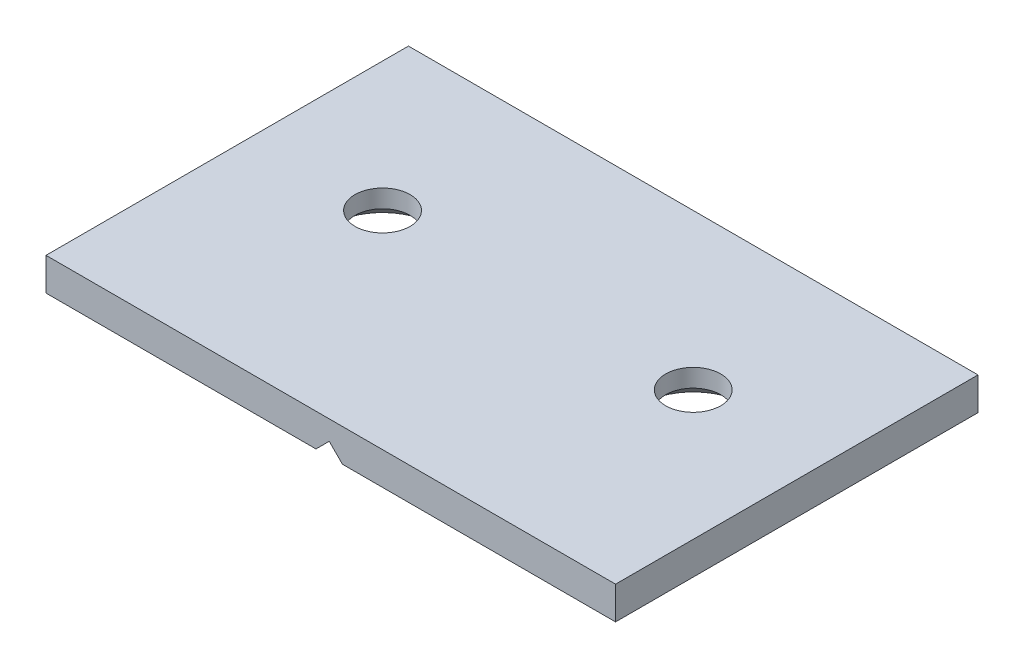
ISO-10303-21;
HEADER;
FILE_DESCRIPTION(('STEP AP214'),'2;1');
FILE_NAME('part.step','',(''),(''),'','','');
FILE_SCHEMA(('AUTOMOTIVE_DESIGN { 1 0 10303 214 1 1 1 1 }'));
ENDSEC;
DATA;
#1=APPLICATION_CONTEXT('core data for automotive mechanical design processes');
#2=APPLICATION_PROTOCOL_DEFINITION('international standard','automotive_design',2000,#1);
#3=PRODUCT_CONTEXT('',#1,'mechanical');
#4=PRODUCT('Part','Part','',(#3));
#5=PRODUCT_RELATED_PRODUCT_CATEGORY('part','',(#4));
#6=PRODUCT_DEFINITION_FORMATION('','',#4);
#7=PRODUCT_DEFINITION_CONTEXT('part definition',#1,'design');
#8=PRODUCT_DEFINITION('design','',#6,#7);
#9=PRODUCT_DEFINITION_SHAPE('','',#8);
#10=(LENGTH_UNIT() NAMED_UNIT(*) SI_UNIT(.MILLI.,.METRE.));
#11=(NAMED_UNIT(*) PLANE_ANGLE_UNIT() SI_UNIT($,.RADIAN.));
#12=(NAMED_UNIT(*) SI_UNIT($,.STERADIAN.) SOLID_ANGLE_UNIT());
#13=UNCERTAINTY_MEASURE_WITH_UNIT(LENGTH_MEASURE(1.E-05),#10,'distance_accuracy_value','');
#14=(GEOMETRIC_REPRESENTATION_CONTEXT(3) GLOBAL_UNCERTAINTY_ASSIGNED_CONTEXT((#13)) GLOBAL_UNIT_ASSIGNED_CONTEXT((#10,
#11,#12)) REPRESENTATION_CONTEXT('',''));
#15=CARTESIAN_POINT('',(0.,0.,0.));
#16=DIRECTION('',(0.,0.,1.));
#17=DIRECTION('',(1.,0.,0.));
#18=AXIS2_PLACEMENT_3D('',#15,#16,#17);
#19=CARTESIAN_POINT('',(0.,0.,0.));
#20=DIRECTION('',(0.,1.,0.));
#21=DIRECTION('',(0.,0.,1.));
#22=AXIS2_PLACEMENT_3D('',#19,#20,#21);
#23=PLANE('',#22);
#24=CARTESIAN_POINT('',(-17.9690173135294,0.,-2.29305555555556));
#25=DIRECTION('',(0.,-1.,0.));
#26=DIRECTION('',(0.,0.,-1.));
#27=AXIS2_PLACEMENT_3D('',#24,#25,#26);
#28=CIRCLE('',#27,6.4389);
#29=CARTESIAN_POINT('',(-17.9690173135294,0.,-8.73195555555556));
#30=VERTEX_POINT('',#29);
#31=EDGE_CURVE('E268',#30,#30,#28,.T.);
#32=ORIENTED_EDGE('',*,*,#31,.F.);
#33=EDGE_LOOP('',(#32));
#34=FACE_BOUND('',#33,.T.);
#35=DIRECTION('',(0.,0.,-1.));
#36=VECTOR('',#35,1.);
#37=CARTESIAN_POINT('',(-33.0820173135294,0.,0.));
#38=LINE('',#37,#36);
#39=CARTESIAN_POINT('',(-33.0820173135294,0.,22.3449444444444));
#40=VERTEX_POINT('',#39);
#41=CARTESIAN_POINT('',(-33.0820173135294,0.,-20.5810555555556));
#42=VERTEX_POINT('',#41);
#43=EDGE_CURVE('E216',#40,#42,#38,.T.);
#44=ORIENTED_EDGE('',*,*,#43,.T.);
#45=DIRECTION('',(1.,0.,0.));
#46=VECTOR('',#45,1.);
#47=CARTESIAN_POINT('',(0.,0.,-20.5810555555556));
#48=LINE('',#47,#46);
#49=CARTESIAN_POINT('',(-1.49888924311914,0.,-20.5810555555556));
#50=VERTEX_POINT('',#49);
#51=EDGE_CURVE('E219',#42,#50,#48,.T.);
#52=ORIENTED_EDGE('',*,*,#51,.T.);
#53=DIRECTION('',(0.,0.,1.));
#54=VECTOR('',#53,1.);
#55=CARTESIAN_POINT('',(-1.49888924311914,0.,0.));
#56=LINE('',#55,#54);
#57=CARTESIAN_POINT('',(-1.49888924311914,0.,22.3449444444444));
#58=VERTEX_POINT('',#57);
#59=EDGE_CURVE('E202',#50,#58,#56,.T.);
#60=ORIENTED_EDGE('',*,*,#59,.T.);
#61=DIRECTION('',(-1.,0.,0.));
#62=VECTOR('',#61,1.);
#63=CARTESIAN_POINT('',(0.,0.,22.3449444444444));
#64=LINE('',#63,#62);
#65=EDGE_CURVE('E213',#58,#40,#64,.T.);
#66=ORIENTED_EDGE('',*,*,#65,.T.);
#67=EDGE_LOOP('',(#44,#52,#60,#66));
#68=FACE_BOUND('',#67,.T.);
#69=ADVANCED_FACE('F47',(#34,#68),#23,.F.);
#70=CARTESIAN_POINT('',(-33.8440173135294,4.7752,-21.3430555555556));
#71=DIRECTION('',(1.,0.,0.));
#72=DIRECTION('',(0.,0.,-1.));
#73=AXIS2_PLACEMENT_3D('',#70,#71,#72);
#74=PLANE('',#73);
#75=DIRECTION('',(0.,-1.,0.));
#76=VECTOR('',#75,1.);
#77=CARTESIAN_POINT('',(-33.8440173135294,4.7752,-21.3430555555556));
#78=LINE('',#77,#76);
#79=CARTESIAN_POINT('',(-33.8440173135294,4.7752,-21.3430555555556));
#80=VERTEX_POINT('',#79);
#81=CARTESIAN_POINT('',(-33.8440173135294,0.761999999999992,-21.3430555555556));
#82=VERTEX_POINT('',#81);
#83=EDGE_CURVE('E184',#80,#82,#78,.T.);
#84=ORIENTED_EDGE('',*,*,#83,.T.);
#85=DIRECTION('',(0.,0.,1.));
#86=VECTOR('',#85,1.);
#87=CARTESIAN_POINT('',(-33.8440173135294,0.761999999999992,-21.3430555555556));
#88=LINE('',#87,#86);
#89=CARTESIAN_POINT('',(-33.8440173135294,0.761999999999992,23.1069444444444));
#90=VERTEX_POINT('',#89);
#91=EDGE_CURVE('E228',#82,#90,#88,.T.);
#92=ORIENTED_EDGE('',*,*,#91,.T.);
#93=DIRECTION('',(0.,-1.,0.));
#94=VECTOR('',#93,1.);
#95=CARTESIAN_POINT('',(-33.8440173135294,4.7752,23.1069444444444));
#96=LINE('',#95,#94);
#97=CARTESIAN_POINT('',(-33.8440173135294,4.7752,23.1069444444444));
#98=VERTEX_POINT('',#97);
#99=EDGE_CURVE('E196',#98,#90,#96,.T.);
#100=ORIENTED_EDGE('',*,*,#99,.F.);
#101=DIRECTION('',(0.,0.,1.));
#102=VECTOR('',#101,1.);
#103=CARTESIAN_POINT('',(-33.8440173135294,4.7752,-21.3430555555556));
#104=LINE('',#103,#102);
#105=EDGE_CURVE('E171',#80,#98,#104,.T.);
#106=ORIENTED_EDGE('',*,*,#105,.F.);
#107=EDGE_LOOP('',(#84,#92,#100,#106));
#108=FACE_BOUND('',#107,.T.);
#109=ADVANCED_FACE('F301',(#108),#74,.F.);
#110=CARTESIAN_POINT('',(-33.8440173135294,4.7752,23.1069444444444));
#111=DIRECTION('',(0.,0.,-1.));
#112=DIRECTION('',(-1.,0.,0.));
#113=AXIS2_PLACEMENT_3D('',#110,#111,#112);
#114=PLANE('',#113);
#115=ORIENTED_EDGE('',*,*,#99,.T.);
#116=DIRECTION('',(1.,0.,0.));
#117=VECTOR('',#116,1.);
#118=CARTESIAN_POINT('',(-33.8440173135294,0.761999999999992,23.1069444444444));
#119=LINE('',#118,#117);
#120=CARTESIAN_POINT('',(-0.736889243119147,0.761999999999991,23.1069444444444));
#121=VERTEX_POINT('',#120);
#122=EDGE_CURVE('E142',#90,#121,#119,.T.);
#123=ORIENTED_EDGE('',*,*,#122,.T.);
#124=DIRECTION('',(0.707106781186546,0.707106781186549,0.));
#125=VECTOR('',#124,1.);
#126=CARTESIAN_POINT('',(0.888710756880871,2.38760000000001,23.1069444444444));
#127=LINE('',#126,#125);
#128=CARTESIAN_POINT('',(0.888710756880871,2.38760000000001,23.1069444444444));
#129=VERTEX_POINT('',#128);
#130=EDGE_CURVE('E133',#121,#129,#127,.T.);
#131=ORIENTED_EDGE('',*,*,#130,.T.);
#132=DIRECTION('',(0.70710678118655,-0.707106781186545,0.));
#133=VECTOR('',#132,1.);
#134=CARTESIAN_POINT('',(0.888710756880871,2.38760000000001,23.1069444444444));
#135=LINE('',#134,#133);
#136=CARTESIAN_POINT('',(2.5143107568809,0.761999999999992,23.1069444444444));
#137=VERTEX_POINT('',#136);
#138=EDGE_CURVE('E139',#129,#137,#135,.T.);
#139=ORIENTED_EDGE('',*,*,#138,.T.);
#140=DIRECTION('',(1.,0.,0.));
#141=VECTOR('',#140,1.);
#142=CARTESIAN_POINT('',(-33.8440173135294,0.761999999999992,23.1069444444444));
#143=LINE('',#142,#141);
#144=CARTESIAN_POINT('',(36.0059826864706,0.761999999999992,23.1069444444444));
#145=VERTEX_POINT('',#144);
#146=EDGE_CURVE('E231',#137,#145,#143,.T.);
#147=ORIENTED_EDGE('',*,*,#146,.T.);
#148=DIRECTION('',(0.,-1.,0.));
#149=VECTOR('',#148,1.);
#150=CARTESIAN_POINT('',(36.0059826864706,4.7752,23.1069444444444));
#151=LINE('',#150,#149);
#152=CARTESIAN_POINT('',(36.0059826864706,4.7752,23.1069444444444));
#153=VERTEX_POINT('',#152);
#154=EDGE_CURVE('E192',#153,#145,#151,.T.);
#155=ORIENTED_EDGE('',*,*,#154,.F.);
#156=DIRECTION('',(1.,0.,0.));
#157=VECTOR('',#156,1.);
#158=CARTESIAN_POINT('',(-33.8440173135294,4.7752,23.1069444444444));
#159=LINE('',#158,#157);
#160=EDGE_CURVE('E175',#98,#153,#159,.T.);
#161=ORIENTED_EDGE('',*,*,#160,.F.);
#162=EDGE_LOOP('',(#115,#123,#131,#139,#147,#155,#161));
#163=FACE_BOUND('',#162,.T.);
#164=ADVANCED_FACE('F136',(#163),#114,.F.);
#165=CARTESIAN_POINT('',(36.0059826864706,4.7752,-21.3430555555556));
#166=DIRECTION('',(-1.,0.,0.));
#167=DIRECTION('',(0.,0.,1.));
#168=AXIS2_PLACEMENT_3D('',#165,#166,#167);
#169=PLANE('',#168);
#170=ORIENTED_EDGE('',*,*,#154,.T.);
#171=DIRECTION('',(0.,0.,-1.));
#172=VECTOR('',#171,1.);
#173=CARTESIAN_POINT('',(36.0059826864706,0.761999999999992,-21.3430555555556));
#174=LINE('',#173,#172);
#175=CARTESIAN_POINT('',(36.0059826864706,0.761999999999992,-21.3430555555556));
#176=VERTEX_POINT('',#175);
#177=EDGE_CURVE('E11',#145,#176,#174,.T.);
#178=ORIENTED_EDGE('',*,*,#177,.T.);
#179=DIRECTION('',(0.,-1.,0.));
#180=VECTOR('',#179,1.);
#181=CARTESIAN_POINT('',(36.0059826864706,4.7752,-21.3430555555556));
#182=LINE('',#181,#180);
#183=CARTESIAN_POINT('',(36.0059826864706,4.7752,-21.3430555555556));
#184=VERTEX_POINT('',#183);
#185=EDGE_CURVE('E188',#184,#176,#182,.T.);
#186=ORIENTED_EDGE('',*,*,#185,.F.);
#187=DIRECTION('',(0.,0.,-1.));
#188=VECTOR('',#187,1.);
#189=CARTESIAN_POINT('',(36.0059826864706,4.7752,-21.3430555555556));
#190=LINE('',#189,#188);
#191=EDGE_CURVE('E178',#153,#184,#190,.T.);
#192=ORIENTED_EDGE('',*,*,#191,.F.);
#193=EDGE_LOOP('',(#170,#178,#186,#192));
#194=FACE_BOUND('',#193,.T.);
#195=ADVANCED_FACE('F342',(#194),#169,.F.);
#196=CARTESIAN_POINT('',(-33.8440173135294,4.7752,-21.3430555555556));
#197=DIRECTION('',(0.,0.,1.));
#198=DIRECTION('',(1.,0.,0.));
#199=AXIS2_PLACEMENT_3D('',#196,#197,#198);
#200=PLANE('',#199);
#201=DIRECTION('',(-0.707106781186546,-0.707106781186549,0.));
#202=VECTOR('',#201,1.);
#203=CARTESIAN_POINT('',(-15.2838532783242,-13.7849640352051,-21.3430555555556));
#204=LINE('',#203,#202);
#205=CARTESIAN_POINT('',(0.888710756880871,2.38760000000001,-21.3430555555556));
#206=VERTEX_POINT('',#205);
#207=CARTESIAN_POINT('',(-0.736889243119144,0.761999999999992,-21.3430555555556));
#208=VERTEX_POINT('',#207);
#209=EDGE_CURVE('E154',#206,#208,#204,.T.);
#210=ORIENTED_EDGE('',*,*,#209,.T.);
#211=DIRECTION('',(-1.,0.,0.));
#212=VECTOR('',#211,1.);
#213=CARTESIAN_POINT('',(-33.8440173135294,0.761999999999992,-21.3430555555556));
#214=LINE('',#213,#212);
#215=EDGE_CURVE('E209',#208,#82,#214,.T.);
#216=ORIENTED_EDGE('',*,*,#215,.T.);
#217=ORIENTED_EDGE('',*,*,#83,.F.);
#218=DIRECTION('',(-1.,0.,0.));
#219=VECTOR('',#218,1.);
#220=CARTESIAN_POINT('',(-33.8440173135294,4.7752,-21.3430555555556));
#221=LINE('',#220,#219);
#222=EDGE_CURVE('E181',#184,#80,#221,.T.);
#223=ORIENTED_EDGE('',*,*,#222,.F.);
#224=ORIENTED_EDGE('',*,*,#185,.T.);
#225=DIRECTION('',(-1.,0.,0.));
#226=VECTOR('',#225,1.);
#227=CARTESIAN_POINT('',(-33.8440173135294,0.761999999999992,-21.3430555555556));
#228=LINE('',#227,#226);
#229=CARTESIAN_POINT('',(2.5143107568809,0.761999999999992,-21.3430555555556));
#230=VERTEX_POINT('',#229);
#231=EDGE_CURVE('E206',#176,#230,#228,.T.);
#232=ORIENTED_EDGE('',*,*,#231,.T.);
#233=DIRECTION('',(-0.70710678118655,0.707106781186545,0.));
#234=VECTOR('',#233,1.);
#235=CARTESIAN_POINT('',(-17.6714532783244,20.9477640352052,-21.3430555555556));
#236=LINE('',#235,#234);
#237=EDGE_CURVE('E158',#230,#206,#236,.T.);
#238=ORIENTED_EDGE('',*,*,#237,.T.);
#239=EDGE_LOOP('',(#210,#216,#217,#223,#224,#232,#238));
#240=FACE_BOUND('',#239,.T.);
#241=ADVANCED_FACE('F296',(#240),#200,.F.);
#242=CARTESIAN_POINT('',(0.,4.7752,0.));
#243=DIRECTION('',(0.,1.,0.));
#244=DIRECTION('',(0.,0.,1.));
#245=AXIS2_PLACEMENT_3D('',#242,#243,#244);
#246=PLANE('',#245);
#247=CARTESIAN_POINT('',(20.1309826864706,4.7752,-2.29305555555556));
#248=DIRECTION('',(0.,1.,0.));
#249=DIRECTION('',(0.,0.,1.));
#250=AXIS2_PLACEMENT_3D('',#247,#248,#249);
#251=CIRCLE('',#250,3.37819999999999);
#252=CARTESIAN_POINT('',(20.1309826864706,4.7752,1.08514444444444));
#253=VERTEX_POINT('',#252);
#254=EDGE_CURVE('E52',#253,#253,#251,.T.);
#255=ORIENTED_EDGE('',*,*,#254,.F.);
#256=EDGE_LOOP('',(#255));
#257=FACE_BOUND('',#256,.T.);
#258=CARTESIAN_POINT('',(-17.9690173135294,4.7752,-2.29305555555556));
#259=DIRECTION('',(0.,1.,0.));
#260=DIRECTION('',(0.,0.,1.));
#261=AXIS2_PLACEMENT_3D('',#258,#259,#260);
#262=CIRCLE('',#261,3.37819999999999);
#263=CARTESIAN_POINT('',(-17.9690173135294,4.7752,1.08514444444444));
#264=VERTEX_POINT('',#263);
#265=EDGE_CURVE('E258',#264,#264,#262,.T.);
#266=ORIENTED_EDGE('',*,*,#265,.F.);
#267=EDGE_LOOP('',(#266));
#268=FACE_BOUND('',#267,.T.);
#269=ORIENTED_EDGE('',*,*,#105,.T.);
#270=ORIENTED_EDGE('',*,*,#160,.T.);
#271=ORIENTED_EDGE('',*,*,#191,.T.);
#272=ORIENTED_EDGE('',*,*,#222,.T.);
#273=EDGE_LOOP('',(#269,#270,#271,#272));
#274=FACE_BOUND('',#273,.T.);
#275=ADVANCED_FACE('F288',(#257,#268,#274),#246,.T.);
#276=CARTESIAN_POINT('',(20.1309826864706,0.,-2.29305555555556));
#277=DIRECTION('',(0.,-1.,0.));
#278=DIRECTION('',(0.,0.,-1.));
#279=AXIS2_PLACEMENT_3D('',#276,#277,#278);
#280=CIRCLE('',#279,6.4389);
#281=CARTESIAN_POINT('',(20.1309826864706,0.,-8.73195555555556));
#282=VERTEX_POINT('',#281);
#283=EDGE_CURVE('E279',#282,#282,#280,.T.);
#284=ORIENTED_EDGE('',*,*,#283,.F.);
#285=EDGE_LOOP('',(#284));
#286=FACE_BOUND('',#285,.T.);
#287=DIRECTION('',(0.,0.,1.));
#288=VECTOR('',#287,1.);
#289=CARTESIAN_POINT('',(35.2439826864706,0.,0.));
#290=LINE('',#289,#288);
#291=CARTESIAN_POINT('',(35.2439826864706,0.,-20.5810555555556));
#292=VERTEX_POINT('',#291);
#293=CARTESIAN_POINT('',(35.2439826864706,0.,22.3449444444444));
#294=VERTEX_POINT('',#293);
#295=EDGE_CURVE('E66',#292,#294,#290,.T.);
#296=ORIENTED_EDGE('',*,*,#295,.T.);
#297=DIRECTION('',(-1.,0.,0.));
#298=VECTOR('',#297,1.);
#299=CARTESIAN_POINT('',(0.,0.,22.3449444444444));
#300=LINE('',#299,#298);
#301=CARTESIAN_POINT('',(3.2763107568809,0.,22.3449444444444));
#302=VERTEX_POINT('',#301);
#303=EDGE_CURVE('E240',#294,#302,#300,.T.);
#304=ORIENTED_EDGE('',*,*,#303,.T.);
#305=DIRECTION('',(0.,0.,-1.));
#306=VECTOR('',#305,1.);
#307=CARTESIAN_POINT('',(3.2763107568809,0.,0.));
#308=LINE('',#307,#306);
#309=CARTESIAN_POINT('',(3.2763107568809,0.,-20.5810555555556));
#310=VERTEX_POINT('',#309);
#311=EDGE_CURVE('E199',#302,#310,#308,.T.);
#312=ORIENTED_EDGE('',*,*,#311,.T.);
#313=DIRECTION('',(1.,0.,0.));
#314=VECTOR('',#313,1.);
#315=CARTESIAN_POINT('',(0.,0.,-20.5810555555556));
#316=LINE('',#315,#314);
#317=EDGE_CURVE('E71',#310,#292,#316,.T.);
#318=ORIENTED_EDGE('',*,*,#317,.T.);
#319=EDGE_LOOP('',(#296,#304,#312,#318));
#320=FACE_BOUND('',#319,.T.);
#321=ADVANCED_FACE('F286',(#286,#320),#23,.F.);
#322=CARTESIAN_POINT('',(0.888710756880871,2.38760000000001,23.1069444444444));
#323=DIRECTION('',(-0.707106781186549,0.707106781186546,0.));
#324=DIRECTION('',(-0.707106781186546,-0.707106781186549,0.));
#325=AXIS2_PLACEMENT_3D('',#322,#323,#324);
#326=PLANE('',#325);
#327=ORIENTED_EDGE('',*,*,#59,.F.);
#328=DIRECTION('',(-0.577350269189623,-0.577350269189625,0.57735026918963));
#329=VECTOR('',#328,1.);
#330=CARTESIAN_POINT('',(-11.7725985999225,-10.2737093568034,-10.3073461987521));
#331=LINE('',#330,#329);
#332=EDGE_CURVE('E225',#50,#208,#331,.F.);
#333=ORIENTED_EDGE('',*,*,#332,.T.);
#334=ORIENTED_EDGE('',*,*,#209,.F.);
#335=DIRECTION('',(0.,0.,-1.));
#336=VECTOR('',#335,1.);
#337=CARTESIAN_POINT('',(0.888710756880871,2.38760000000001,23.1069444444444));
#338=LINE('',#337,#336);
#339=EDGE_CURVE('E150',#129,#206,#338,.T.);
#340=ORIENTED_EDGE('',*,*,#339,.F.);
#341=ORIENTED_EDGE('',*,*,#130,.F.);
#342=DIRECTION('',(0.577350269189623,0.577350269189625,0.57735026918963));
#343=VECTOR('',#342,1.);
#344=CARTESIAN_POINT('',(-11.7725985999225,-10.2737093568034,12.071235087641));
#345=LINE('',#344,#343);
#346=EDGE_CURVE('E222',#121,#58,#345,.F.);
#347=ORIENTED_EDGE('',*,*,#346,.T.);
#348=EDGE_LOOP('',(#327,#333,#334,#340,#341,#347));
#349=FACE_BOUND('',#348,.T.);
#350=ADVANCED_FACE('F152',(#349),#326,.F.);
#351=CARTESIAN_POINT('',(0.888710756880871,2.38760000000001,23.1069444444444));
#352=DIRECTION('',(0.707106781186545,0.70710678118655,0.));
#353=DIRECTION('',(-0.70710678118655,0.707106781186545,0.));
#354=AXIS2_PLACEMENT_3D('',#351,#352,#353);
#355=PLANE('',#354);
#356=ORIENTED_EDGE('',*,*,#311,.F.);
#357=DIRECTION('',(0.577350269189627,-0.577350269189623,-0.577350269189628));
#358=VECTOR('',#357,1.);
#359=CARTESIAN_POINT('',(-9.6051319332559,12.8814426901367,35.2263871345813));
#360=LINE('',#359,#358);
#361=EDGE_CURVE('E58',#302,#137,#360,.F.);
#362=ORIENTED_EDGE('',*,*,#361,.T.);
#363=ORIENTED_EDGE('',*,*,#138,.F.);
#364=ORIENTED_EDGE('',*,*,#339,.T.);
#365=ORIENTED_EDGE('',*,*,#237,.F.);
#366=DIRECTION('',(-0.577350269189627,0.577350269189623,-0.577350269189628));
#367=VECTOR('',#366,1.);
#368=CARTESIAN_POINT('',(-9.60513193325591,12.8814426901367,-33.4624982456924));
#369=LINE('',#368,#367);
#370=EDGE_CURVE('E243',#230,#310,#369,.F.);
#371=ORIENTED_EDGE('',*,*,#370,.T.);
#372=EDGE_LOOP('',(#356,#362,#363,#364,#365,#371));
#373=FACE_BOUND('',#372,.T.);
#374=ADVANCED_FACE('F161',(#373),#355,.F.);
#375=CARTESIAN_POINT('',(-33.8440173135294,0.761999999999992,23.1069444444444));
#376=DIRECTION('',(0.,0.707106781186551,-0.707106781186544));
#377=DIRECTION('',(1.,0.,0.));
#378=AXIS2_PLACEMENT_3D('',#375,#376,#377);
#379=PLANE('',#378);
#380=ORIENTED_EDGE('',*,*,#346,.F.);
#381=ORIENTED_EDGE('',*,*,#122,.F.);
#382=DIRECTION('',(0.577350269189628,-0.577350269189622,-0.577350269189628));
#383=VECTOR('',#382,1.);
#384=CARTESIAN_POINT('',(-33.8440173135294,0.761999999999992,23.1069444444444));
#385=LINE('',#384,#383);
#386=EDGE_CURVE('E146',#40,#90,#385,.F.);
#387=ORIENTED_EDGE('',*,*,#386,.F.);
#388=ORIENTED_EDGE('',*,*,#65,.F.);
#389=EDGE_LOOP('',(#380,#381,#387,#388));
#390=FACE_BOUND('',#389,.T.);
#391=ADVANCED_FACE('F362',(#390),#379,.F.);
#392=CARTESIAN_POINT('',(-33.8440173135294,0.761999999999992,-21.3430555555556));
#393=DIRECTION('',(0.707106781186544,0.707106781186551,0.));
#394=DIRECTION('',(0.,0.,1.));
#395=AXIS2_PLACEMENT_3D('',#392,#393,#394);
#396=PLANE('',#395);
#397=ORIENTED_EDGE('',*,*,#386,.T.);
#398=ORIENTED_EDGE('',*,*,#91,.F.);
#399=DIRECTION('',(0.577350269189628,-0.577350269189622,0.577350269189627));
#400=VECTOR('',#399,1.);
#401=CARTESIAN_POINT('',(-33.8440173135294,0.761999999999992,-21.3430555555556));
#402=LINE('',#401,#400);
#403=EDGE_CURVE('E248',#42,#82,#402,.F.);
#404=ORIENTED_EDGE('',*,*,#403,.F.);
#405=ORIENTED_EDGE('',*,*,#43,.F.);
#406=EDGE_LOOP('',(#397,#398,#404,#405));
#407=FACE_BOUND('',#406,.T.);
#408=ADVANCED_FACE('F322',(#407),#396,.F.);
#409=CARTESIAN_POINT('',(-33.8440173135294,0.761999999999992,-21.3430555555556));
#410=DIRECTION('',(0.,0.707106781186551,0.707106781186544));
#411=DIRECTION('',(-1.,0.,0.));
#412=AXIS2_PLACEMENT_3D('',#409,#410,#411);
#413=PLANE('',#412);
#414=ORIENTED_EDGE('',*,*,#332,.F.);
#415=ORIENTED_EDGE('',*,*,#51,.F.);
#416=ORIENTED_EDGE('',*,*,#403,.T.);
#417=ORIENTED_EDGE('',*,*,#215,.F.);
#418=EDGE_LOOP('',(#414,#415,#416,#417));
#419=FACE_BOUND('',#418,.T.);
#420=ADVANCED_FACE('F319',(#419),#413,.F.);
#421=CARTESIAN_POINT('',(-33.8440173135294,0.761999999999992,-21.3430555555556));
#422=DIRECTION('',(0.,0.707106781186551,0.707106781186544));
#423=DIRECTION('',(-1.,0.,0.));
#424=AXIS2_PLACEMENT_3D('',#421,#422,#423);
#425=PLANE('',#424);
#426=ORIENTED_EDGE('',*,*,#370,.F.);
#427=ORIENTED_EDGE('',*,*,#231,.F.);
#428=DIRECTION('',(-0.577350269189626,-0.577350269189623,0.577350269189628));
#429=VECTOR('',#428,1.);
#430=CARTESIAN_POINT('',(12.7226493531372,-22.5213333333332,1.94027777777788));
#431=LINE('',#430,#429);
#432=EDGE_CURVE('E251',#292,#176,#431,.F.);
#433=ORIENTED_EDGE('',*,*,#432,.F.);
#434=ORIENTED_EDGE('',*,*,#317,.F.);
#435=EDGE_LOOP('',(#426,#427,#433,#434));
#436=FACE_BOUND('',#435,.T.);
#437=ADVANCED_FACE('F50',(#436),#425,.F.);
#438=CARTESIAN_POINT('',(36.0059826864706,0.761999999999992,-21.3430555555556));
#439=DIRECTION('',(-0.707106781186546,0.707106781186549,0.));
#440=DIRECTION('',(0.,0.,-1.));
#441=AXIS2_PLACEMENT_3D('',#438,#439,#440);
#442=PLANE('',#441);
#443=ORIENTED_EDGE('',*,*,#432,.T.);
#444=ORIENTED_EDGE('',*,*,#177,.F.);
#445=DIRECTION('',(-0.577350269189626,-0.577350269189623,-0.577350269189629));
#446=VECTOR('',#445,1.);
#447=CARTESIAN_POINT('',(21.1893160198038,-14.0546666666667,8.29027777777764));
#448=LINE('',#447,#446);
#449=EDGE_CURVE('E255',#294,#145,#448,.F.);
#450=ORIENTED_EDGE('',*,*,#449,.F.);
#451=ORIENTED_EDGE('',*,*,#295,.F.);
#452=EDGE_LOOP('',(#443,#444,#450,#451));
#453=FACE_BOUND('',#452,.T.);
#454=ADVANCED_FACE('F338',(#453),#442,.F.);
#455=CARTESIAN_POINT('',(-33.8440173135294,0.761999999999992,23.1069444444444));
#456=DIRECTION('',(0.,0.707106781186551,-0.707106781186544));
#457=DIRECTION('',(1.,0.,0.));
#458=AXIS2_PLACEMENT_3D('',#455,#456,#457);
#459=PLANE('',#458);
#460=ORIENTED_EDGE('',*,*,#361,.F.);
#461=ORIENTED_EDGE('',*,*,#303,.F.);
#462=ORIENTED_EDGE('',*,*,#449,.T.);
#463=ORIENTED_EDGE('',*,*,#146,.F.);
#464=EDGE_LOOP('',(#460,#461,#462,#463));
#465=FACE_BOUND('',#464,.T.);
#466=ADVANCED_FACE('F341',(#465),#459,.F.);
#467=CARTESIAN_POINT('',(-17.9690173135294,0.,-2.29305555555556));
#468=DIRECTION('',(0.,-1.,0.));
#469=DIRECTION('',(0.,0.,-1.));
#470=AXIS2_PLACEMENT_3D('',#467,#468,#469);
#471=CYLINDRICAL_SURFACE('',#470,3.37819999999999);
#472=ORIENTED_EDGE('',*,*,#265,.T.);
#473=EDGE_LOOP('',(#472));
#474=FACE_BOUND('',#473,.T.);
#475=CARTESIAN_POINT('',(-17.9690173135294,2.5682322411443,-2.29305555555556));
#476=DIRECTION('',(0.,-1.,0.));
#477=DIRECTION('',(0.,0.,-1.));
#478=AXIS2_PLACEMENT_3D('',#475,#476,#477);
#479=CIRCLE('',#478,3.3782);
#480=CARTESIAN_POINT('',(-17.9690173135294,2.5682322411443,-5.67125555555555));
#481=VERTEX_POINT('',#480);
#482=EDGE_CURVE('E263',#481,#481,#479,.T.);
#483=ORIENTED_EDGE('',*,*,#482,.T.);
#484=EDGE_LOOP('',(#483));
#485=FACE_BOUND('',#484,.T.);
#486=ADVANCED_FACE('F372',(#474,#485),#471,.F.);
#487=CARTESIAN_POINT('',(-17.9690173135294,0.,-2.29305555555556));
#488=DIRECTION('',(0.,-1.,0.));
#489=DIRECTION('',(0.,0.,-1.));
#490=AXIS2_PLACEMENT_3D('',#487,#488,#489);
#491=CONICAL_SURFACE('',#490,6.4389,0.872664625997164);
#492=ORIENTED_EDGE('',*,*,#482,.F.);
#493=EDGE_LOOP('',(#492));
#494=FACE_BOUND('',#493,.T.);
#495=ORIENTED_EDGE('',*,*,#31,.T.);
#496=EDGE_LOOP('',(#495));
#497=FACE_BOUND('',#496,.T.);
#498=ADVANCED_FACE('F454',(#494,#497),#491,.F.);
#499=CARTESIAN_POINT('',(20.1309826864706,0.,-2.29305555555556));
#500=DIRECTION('',(0.,-1.,0.));
#501=DIRECTION('',(0.,0.,-1.));
#502=AXIS2_PLACEMENT_3D('',#499,#500,#501);
#503=CYLINDRICAL_SURFACE('',#502,3.37819999999999);
#504=ORIENTED_EDGE('',*,*,#254,.T.);
#505=EDGE_LOOP('',(#504));
#506=FACE_BOUND('',#505,.T.);
#507=CARTESIAN_POINT('',(20.1309826864706,2.5682322411443,-2.29305555555556));
#508=DIRECTION('',(0.,-1.,0.));
#509=DIRECTION('',(0.,0.,-1.));
#510=AXIS2_PLACEMENT_3D('',#507,#508,#509);
#511=CIRCLE('',#510,3.3782);
#512=CARTESIAN_POINT('',(20.1309826864706,2.5682322411443,-5.67125555555555));
#513=VERTEX_POINT('',#512);
#514=EDGE_CURVE('E275',#513,#513,#511,.T.);
#515=ORIENTED_EDGE('',*,*,#514,.T.);
#516=EDGE_LOOP('',(#515));
#517=FACE_BOUND('',#516,.T.);
#518=ADVANCED_FACE('F462',(#506,#517),#503,.F.);
#519=CARTESIAN_POINT('',(20.1309826864706,0.,-2.29305555555556));
#520=DIRECTION('',(0.,-1.,0.));
#521=DIRECTION('',(0.,0.,-1.));
#522=AXIS2_PLACEMENT_3D('',#519,#520,#521);
#523=CONICAL_SURFACE('',#522,6.4389,0.872664625997165);
#524=ORIENTED_EDGE('',*,*,#514,.F.);
#525=EDGE_LOOP('',(#524));
#526=FACE_BOUND('',#525,.T.);
#527=ORIENTED_EDGE('',*,*,#283,.T.);
#528=EDGE_LOOP('',(#527));
#529=FACE_BOUND('',#528,.T.);
#530=ADVANCED_FACE('F284',(#526,#529),#523,.F.);
#531=CLOSED_SHELL('',(#69,#109,#164,#195,#241,#275,#321,#350,#374,#391,#408,#420,#437,#454,#466,
#486,#498,#518,#530));
#532=MANIFOLD_SOLID_BREP('B2',#531);
#533=ADVANCED_BREP_SHAPE_REPRESENTATION('',(#18,#532),#14);
#534=SHAPE_DEFINITION_REPRESENTATION(#9,#533);
ENDSEC;
END-ISO-10303-21;
